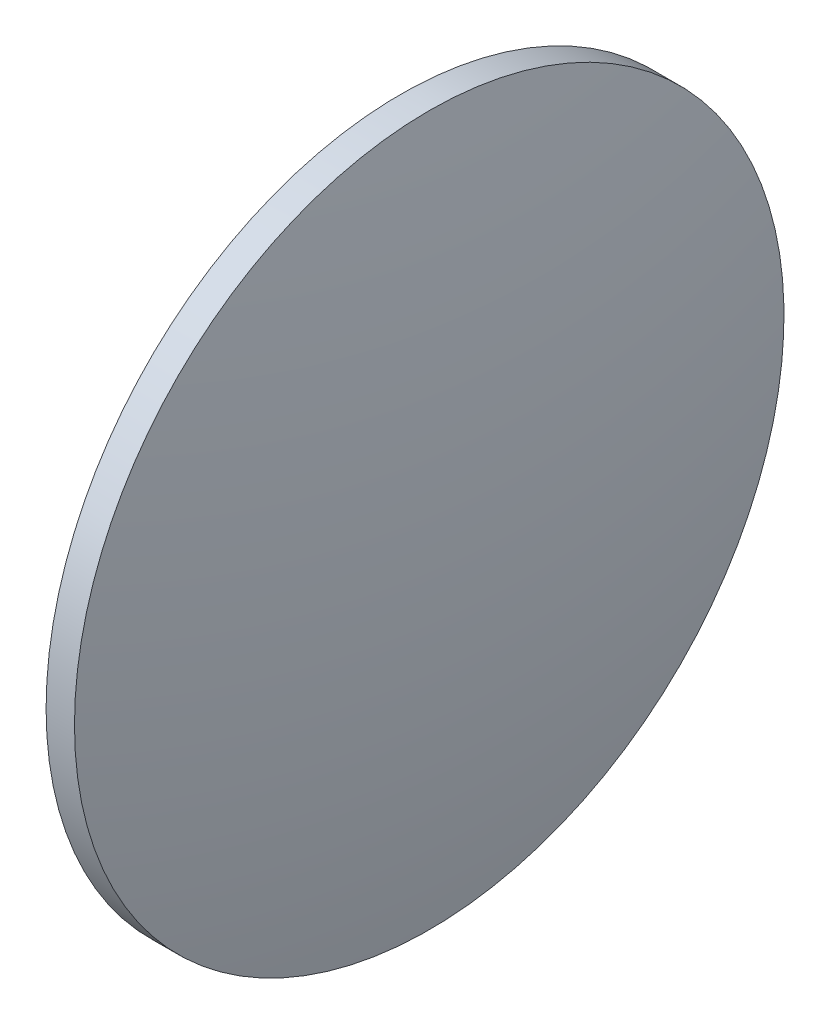
ISO-10303-21;
HEADER;
FILE_DESCRIPTION(('STEP AP214'),'2;1');
FILE_NAME('part.step','',(''),(''),'','','');
FILE_SCHEMA(('AUTOMOTIVE_DESIGN { 1 0 10303 214 1 1 1 1 }'));
ENDSEC;
DATA;
#1=APPLICATION_CONTEXT('core data for automotive mechanical design processes');
#2=APPLICATION_PROTOCOL_DEFINITION('international standard','automotive_design',2000,#1);
#3=PRODUCT_CONTEXT('',#1,'mechanical');
#4=PRODUCT('Part','Part','',(#3));
#5=PRODUCT_RELATED_PRODUCT_CATEGORY('part','',(#4));
#6=PRODUCT_DEFINITION_FORMATION('','',#4);
#7=PRODUCT_DEFINITION_CONTEXT('part definition',#1,'design');
#8=PRODUCT_DEFINITION('design','',#6,#7);
#9=PRODUCT_DEFINITION_SHAPE('','',#8);
#10=(LENGTH_UNIT() NAMED_UNIT(*) SI_UNIT(.MILLI.,.METRE.));
#11=(NAMED_UNIT(*) PLANE_ANGLE_UNIT() SI_UNIT($,.RADIAN.));
#12=(NAMED_UNIT(*) SI_UNIT($,.STERADIAN.) SOLID_ANGLE_UNIT());
#13=UNCERTAINTY_MEASURE_WITH_UNIT(LENGTH_MEASURE(1.E-05),#10,'distance_accuracy_value','');
#14=(GEOMETRIC_REPRESENTATION_CONTEXT(3) GLOBAL_UNCERTAINTY_ASSIGNED_CONTEXT((#13)) GLOBAL_UNIT_ASSIGNED_CONTEXT((#10,
#11,#12)) REPRESENTATION_CONTEXT('',''));
#15=CARTESIAN_POINT('',(0.,0.,0.));
#16=DIRECTION('',(0.,0.,1.));
#17=DIRECTION('',(1.,0.,0.));
#18=AXIS2_PLACEMENT_3D('',#15,#16,#17);
#19=CARTESIAN_POINT('',(-23.2073746152228,130.467109852824,0.));
#20=DIRECTION('',(-1.,0.,0.));
#21=DIRECTION('',(0.,1.,0.));
#22=AXIS2_PLACEMENT_3D('',#19,#20,#21);
#23=SPHERICAL_SURFACE('',#22,258.068721881391);
#24=CARTESIAN_POINT('',(229.971347266169,130.467109852824,0.));
#25=DIRECTION('',(-1.,0.,0.));
#26=DIRECTION('',(0.,0.,1.));
#27=AXIS2_PLACEMENT_3D('',#24,#25,#26);
#28=CIRCLE('',#27,50.);
#29=CARTESIAN_POINT('',(229.971347266169,130.467109852824,50.));
#30=VERTEX_POINT('',#29);
#31=EDGE_CURVE('E10',#30,#30,#28,.T.);
#32=ORIENTED_EDGE('',*,*,#31,.F.);
#33=EDGE_LOOP('',(#32));
#34=FACE_BOUND('',#33,.T.);
#35=ADVANCED_FACE('F35',(#34),#23,.T.);
#36=CARTESIAN_POINT('',(217.994582532387,130.467109852824,0.));
#37=DIRECTION('',(-1.,0.,0.));
#38=DIRECTION('',(0.,0.,1.));
#39=AXIS2_PLACEMENT_3D('',#36,#37,#38);
#40=CYLINDRICAL_SURFACE('',#39,50.);
#41=CARTESIAN_POINT('',(225.971347266169,130.467109852824,0.));
#42=DIRECTION('',(-1.,0.,0.));
#43=DIRECTION('',(0.,0.,1.));
#44=AXIS2_PLACEMENT_3D('',#41,#42,#43);
#45=CIRCLE('',#44,50.);
#46=CARTESIAN_POINT('',(225.971347266169,130.467109852824,50.));
#47=VERTEX_POINT('',#46);
#48=EDGE_CURVE('E41',#47,#47,#45,.T.);
#49=ORIENTED_EDGE('',*,*,#48,.F.);
#50=EDGE_LOOP('',(#49));
#51=FACE_BOUND('',#50,.T.);
#52=ORIENTED_EDGE('',*,*,#31,.T.);
#53=EDGE_LOOP('',(#52));
#54=FACE_BOUND('',#53,.T.);
#55=ADVANCED_FACE('F49',(#51,#54),#40,.T.);
#56=CARTESIAN_POINT('',(225.971347266169,130.467109852824,0.));
#57=DIRECTION('',(1.,0.,0.));
#58=DIRECTION('',(0.,0.,-1.));
#59=AXIS2_PLACEMENT_3D('',#56,#57,#58);
#60=PLANE('',#59);
#61=ORIENTED_EDGE('',*,*,#48,.T.);
#62=EDGE_LOOP('',(#61));
#63=FACE_BOUND('',#62,.T.);
#64=ADVANCED_FACE('F47',(#63),#60,.F.);
#65=CLOSED_SHELL('',(#35,#55,#64));
#66=MANIFOLD_SOLID_BREP('B2',#65);
#67=ADVANCED_BREP_SHAPE_REPRESENTATION('',(#18,#66),#14);
#68=SHAPE_DEFINITION_REPRESENTATION(#9,#67);
ENDSEC;
END-ISO-10303-21;
